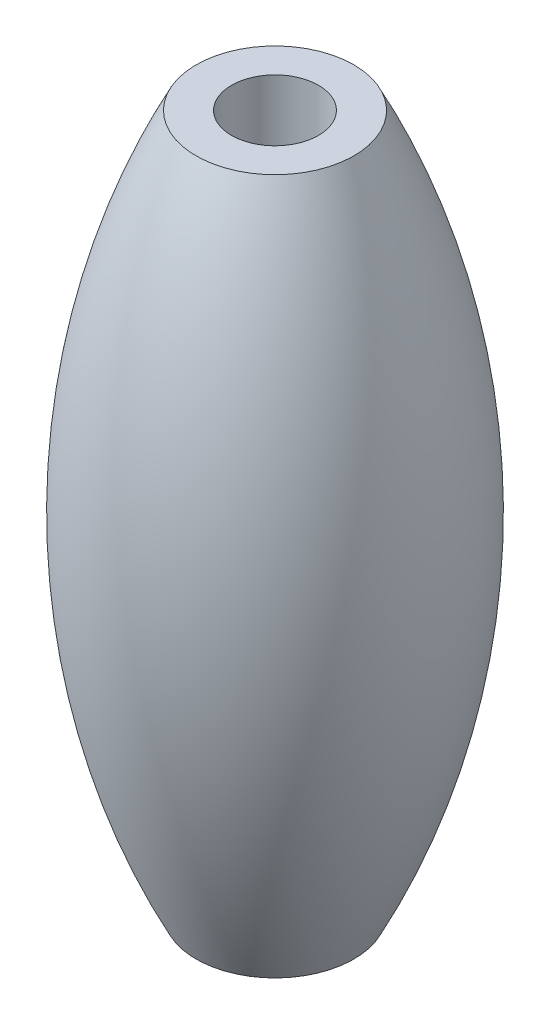
ISO-10303-21;
HEADER;
FILE_DESCRIPTION(('STEP AP214'),'2;1');
FILE_NAME('part.step','',(''),(''),'','','');
FILE_SCHEMA(('AUTOMOTIVE_DESIGN { 1 0 10303 214 1 1 1 1 }'));
ENDSEC;
DATA;
#1=APPLICATION_CONTEXT('core data for automotive mechanical design processes');
#2=APPLICATION_PROTOCOL_DEFINITION('international standard','automotive_design',2000,#1);
#3=PRODUCT_CONTEXT('',#1,'mechanical');
#4=PRODUCT('Part','Part','',(#3));
#5=PRODUCT_RELATED_PRODUCT_CATEGORY('part','',(#4));
#6=PRODUCT_DEFINITION_FORMATION('','',#4);
#7=PRODUCT_DEFINITION_CONTEXT('part definition',#1,'design');
#8=PRODUCT_DEFINITION('design','',#6,#7);
#9=PRODUCT_DEFINITION_SHAPE('','',#8);
#10=(LENGTH_UNIT() NAMED_UNIT(*) SI_UNIT(.MILLI.,.METRE.));
#11=(NAMED_UNIT(*) PLANE_ANGLE_UNIT() SI_UNIT($,.RADIAN.));
#12=(NAMED_UNIT(*) SI_UNIT($,.STERADIAN.) SOLID_ANGLE_UNIT());
#13=UNCERTAINTY_MEASURE_WITH_UNIT(LENGTH_MEASURE(1.E-05),#10,'distance_accuracy_value','');
#14=(GEOMETRIC_REPRESENTATION_CONTEXT(3) GLOBAL_UNCERTAINTY_ASSIGNED_CONTEXT((#13)) GLOBAL_UNIT_ASSIGNED_CONTEXT((#10,
#11,#12)) REPRESENTATION_CONTEXT('',''));
#15=CARTESIAN_POINT('',(0.,0.,0.));
#16=DIRECTION('',(0.,0.,1.));
#17=DIRECTION('',(1.,0.,0.));
#18=AXIS2_PLACEMENT_3D('',#15,#16,#17);
#19=CARTESIAN_POINT('',(0.,-14.,0.));
#20=DIRECTION('',(0.,-1.,0.));
#21=DIRECTION('',(0.,0.,-1.));
#22=AXIS2_PLACEMENT_3D('',#19,#20,#21);
#23=PLANE('',#22);
#24=CARTESIAN_POINT('',(0.,-14.,0.));
#25=DIRECTION('',(0.,1.,0.));
#26=DIRECTION('',(0.,0.,1.));
#27=AXIS2_PLACEMENT_3D('',#24,#25,#26);
#28=CIRCLE('',#27,1.75);
#29=CARTESIAN_POINT('',(0.,-14.,1.75));
#30=VERTEX_POINT('',#29);
#31=EDGE_CURVE('E56',#30,#30,#28,.T.);
#32=ORIENTED_EDGE('',*,*,#31,.T.);
#33=EDGE_LOOP('',(#32));
#34=FACE_BOUND('',#33,.T.);
#35=CARTESIAN_POINT('',(0.,-14.,0.));
#36=DIRECTION('',(0.,-1.,0.));
#37=DIRECTION('',(0.,0.,-1.));
#38=AXIS2_PLACEMENT_3D('',#35,#36,#37);
#39=CIRCLE('',#38,3.175);
#40=CARTESIAN_POINT('',(0.,-14.,-3.175));
#41=VERTEX_POINT('',#40);
#42=EDGE_CURVE('E52',#41,#41,#39,.T.);
#43=ORIENTED_EDGE('',*,*,#42,.T.);
#44=EDGE_LOOP('',(#43));
#45=FACE_BOUND('',#44,.T.);
#46=ADVANCED_FACE('F46',(#34,#45),#23,.T.);
#47=CARTESIAN_POINT('',(0.,14.,0.));
#48=DIRECTION('',(0.,1.,0.));
#49=DIRECTION('',(0.,0.,1.));
#50=AXIS2_PLACEMENT_3D('',#47,#48,#49);
#51=PLANE('',#50);
#52=CARTESIAN_POINT('',(0.,14.,0.));
#53=DIRECTION('',(0.,1.,0.));
#54=DIRECTION('',(0.,0.,1.));
#55=AXIS2_PLACEMENT_3D('',#52,#53,#54);
#56=CIRCLE('',#55,1.75);
#57=CARTESIAN_POINT('',(0.,14.,1.75));
#58=VERTEX_POINT('',#57);
#59=EDGE_CURVE('E60',#58,#58,#56,.T.);
#60=ORIENTED_EDGE('',*,*,#59,.F.);
#61=EDGE_LOOP('',(#60));
#62=FACE_BOUND('',#61,.T.);
#63=CARTESIAN_POINT('',(0.,14.,0.));
#64=DIRECTION('',(0.,-1.,0.));
#65=DIRECTION('',(0.,0.,-1.));
#66=AXIS2_PLACEMENT_3D('',#63,#64,#65);
#67=CIRCLE('',#66,3.175);
#68=CARTESIAN_POINT('',(0.,14.,-3.175));
#69=VERTEX_POINT('',#68);
#70=EDGE_CURVE('E12',#69,#69,#67,.T.);
#71=ORIENTED_EDGE('',*,*,#70,.F.);
#72=EDGE_LOOP('',(#71));
#73=FACE_BOUND('',#72,.T.);
#74=ADVANCED_FACE('F68',(#62,#73),#51,.T.);
#75=CARTESIAN_POINT('',(0.,0.,0.));
#76=DIRECTION('',(0.,-1.,0.));
#77=DIRECTION('',(0.,0.,-1.));
#78=AXIS2_PLACEMENT_3D('',#75,#76,#77);
#79=DEGENERATE_TOROIDAL_SURFACE('',#78,24.6361842105263,31.1361842105263,.F.);
#80=ORIENTED_EDGE('',*,*,#70,.T.);
#81=EDGE_LOOP('',(#80));
#82=FACE_BOUND('',#81,.T.);
#83=ORIENTED_EDGE('',*,*,#42,.F.);
#84=EDGE_LOOP('',(#83));
#85=FACE_BOUND('',#84,.T.);
#86=ADVANCED_FACE('F71',(#82,#85),#79,.F.);
#87=CARTESIAN_POINT('',(0.,14.,0.));
#88=DIRECTION('',(0.,1.,0.));
#89=DIRECTION('',(0.,0.,1.));
#90=AXIS2_PLACEMENT_3D('',#87,#88,#89);
#91=CYLINDRICAL_SURFACE('',#90,1.75);
#92=ORIENTED_EDGE('',*,*,#31,.F.);
#93=EDGE_LOOP('',(#92));
#94=FACE_BOUND('',#93,.T.);
#95=ORIENTED_EDGE('',*,*,#59,.T.);
#96=EDGE_LOOP('',(#95));
#97=FACE_BOUND('',#96,.T.);
#98=ADVANCED_FACE('F66',(#94,#97),#91,.F.);
#99=CLOSED_SHELL('',(#46,#74,#86,#98));
#100=MANIFOLD_SOLID_BREP('B2',#99);
#101=ADVANCED_BREP_SHAPE_REPRESENTATION('',(#18,#100),#14);
#102=SHAPE_DEFINITION_REPRESENTATION(#9,#101);
ENDSEC;
END-ISO-10303-21;
